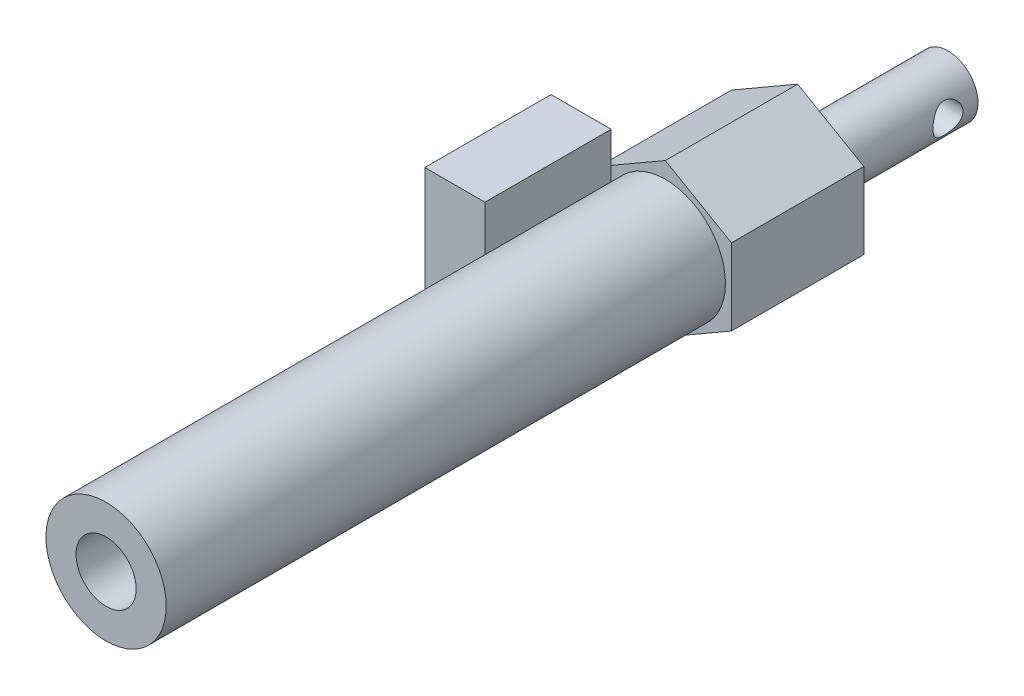
ISO-10303-21;
HEADER;
FILE_DESCRIPTION(('STEP AP214'),'2;1');
FILE_NAME('part.step','',(''),(''),'','','');
FILE_SCHEMA(('AUTOMOTIVE_DESIGN { 1 0 10303 214 1 1 1 1 }'));
ENDSEC;
DATA;
#1=APPLICATION_CONTEXT('core data for automotive mechanical design processes');
#2=APPLICATION_PROTOCOL_DEFINITION('international standard','automotive_design',2000,#1);
#3=PRODUCT_CONTEXT('',#1,'mechanical');
#4=PRODUCT('Part','Part','',(#3));
#5=PRODUCT_RELATED_PRODUCT_CATEGORY('part','',(#4));
#6=PRODUCT_DEFINITION_FORMATION('','',#4);
#7=PRODUCT_DEFINITION_CONTEXT('part definition',#1,'design');
#8=PRODUCT_DEFINITION('design','',#6,#7);
#9=PRODUCT_DEFINITION_SHAPE('','',#8);
#10=(LENGTH_UNIT() NAMED_UNIT(*) SI_UNIT(.MILLI.,.METRE.));
#11=(NAMED_UNIT(*) PLANE_ANGLE_UNIT() SI_UNIT($,.RADIAN.));
#12=(NAMED_UNIT(*) SI_UNIT($,.STERADIAN.) SOLID_ANGLE_UNIT());
#13=UNCERTAINTY_MEASURE_WITH_UNIT(LENGTH_MEASURE(1.E-05),#10,'distance_accuracy_value','');
#14=(GEOMETRIC_REPRESENTATION_CONTEXT(3) GLOBAL_UNCERTAINTY_ASSIGNED_CONTEXT((#13)) GLOBAL_UNIT_ASSIGNED_CONTEXT((#10,
#11,#12)) REPRESENTATION_CONTEXT('',''));
#15=CARTESIAN_POINT('',(0.,0.,0.));
#16=DIRECTION('',(0.,0.,1.));
#17=DIRECTION('',(1.,0.,0.));
#18=AXIS2_PLACEMENT_3D('',#15,#16,#17);
#19=CARTESIAN_POINT('',(0.,0.,115.));
#20=DIRECTION('',(0.,0.,-1.));
#21=DIRECTION('',(-1.,0.,0.));
#22=AXIS2_PLACEMENT_3D('',#19,#20,#21);
#23=CYLINDRICAL_SURFACE('',#22,10.);
#24=CARTESIAN_POINT('',(0.,0.,115.));
#25=DIRECTION('',(0.,0.,1.));
#26=DIRECTION('',(1.,0.,0.));
#27=AXIS2_PLACEMENT_3D('',#24,#25,#26);
#28=CIRCLE('',#27,10.);
#29=CARTESIAN_POINT('',(10.,0.,115.));
#30=VERTEX_POINT('',#29);
#31=EDGE_CURVE('E249',#30,#30,#28,.T.);
#32=ORIENTED_EDGE('',*,*,#31,.F.);
#33=EDGE_LOOP('',(#32));
#34=FACE_BOUND('',#33,.T.);
#35=CARTESIAN_POINT('',(0.,0.,43.));
#36=DIRECTION('',(0.,0.,-1.));
#37=DIRECTION('',(-1.,0.,0.));
#38=AXIS2_PLACEMENT_3D('',#35,#36,#37);
#39=CIRCLE('',#38,10.);
#40=CARTESIAN_POINT('',(-9.,-4.35889894354067,43.));
#41=VERTEX_POINT('',#40);
#42=CARTESIAN_POINT('',(-9.,4.35889894354068,43.));
#43=VERTEX_POINT('',#42);
#44=EDGE_CURVE('E41',#41,#43,#39,.T.);
#45=ORIENTED_EDGE('',*,*,#44,.F.);
#46=DIRECTION('',(0.,0.,-1.));
#47=VECTOR('',#46,1.);
#48=CARTESIAN_POINT('',(-9.,-4.35889894354067,115.));
#49=LINE('',#48,#47);
#50=CARTESIAN_POINT('',(-9.,-4.35889894354068,22.));
#51=VERTEX_POINT('',#50);
#52=EDGE_CURVE('E196',#41,#51,#49,.T.);
#53=ORIENTED_EDGE('',*,*,#52,.T.);
#54=CARTESIAN_POINT('',(0.,0.,22.));
#55=DIRECTION('',(0.,0.,-1.));
#56=DIRECTION('',(-1.,0.,0.));
#57=AXIS2_PLACEMENT_3D('',#54,#55,#56);
#58=CIRCLE('',#57,10.);
#59=CARTESIAN_POINT('',(-9.,4.35889894354067,22.));
#60=VERTEX_POINT('',#59);
#61=EDGE_CURVE('E253',#60,#51,#58,.T.);
#62=ORIENTED_EDGE('',*,*,#61,.F.);
#63=DIRECTION('',(0.,0.,-1.));
#64=VECTOR('',#63,1.);
#65=CARTESIAN_POINT('',(-9.,4.35889894354067,115.));
#66=LINE('',#65,#64);
#67=EDGE_CURVE('E154',#60,#43,#66,.F.);
#68=ORIENTED_EDGE('',*,*,#67,.T.);
#69=EDGE_LOOP('',(#45,#53,#62,#68));
#70=FACE_BOUND('',#69,.T.);
#71=ADVANCED_FACE('F38',(#34,#70),#23,.T.);
#72=CARTESIAN_POINT('',(0.,0.,115.));
#73=DIRECTION('',(0.,0.,1.));
#74=DIRECTION('',(1.,0.,0.));
#75=AXIS2_PLACEMENT_3D('',#72,#73,#74);
#76=PLANE('',#75);
#77=CARTESIAN_POINT('',(0.,0.,115.));
#78=DIRECTION('',(0.,0.,1.));
#79=DIRECTION('',(1.,0.,0.));
#80=AXIS2_PLACEMENT_3D('',#77,#78,#79);
#81=CIRCLE('',#80,5.);
#82=CARTESIAN_POINT('',(5.,0.,115.));
#83=VERTEX_POINT('',#82);
#84=EDGE_CURVE('E243',#83,#83,#81,.T.);
#85=ORIENTED_EDGE('',*,*,#84,.F.);
#86=EDGE_LOOP('',(#85));
#87=FACE_BOUND('',#86,.T.);
#88=ORIENTED_EDGE('',*,*,#31,.T.);
#89=EDGE_LOOP('',(#88));
#90=FACE_BOUND('',#89,.T.);
#91=ADVANCED_FACE('F287',(#87,#90),#76,.T.);
#92=CARTESIAN_POINT('',(0.,0.,5.));
#93=DIRECTION('',(0.,0.,1.));
#94=DIRECTION('',(1.,0.,0.));
#95=AXIS2_PLACEMENT_3D('',#92,#93,#94);
#96=CYLINDRICAL_SURFACE('',#95,5.);
#97=CARTESIAN_POINT('',(0.,0.,5.));
#98=DIRECTION('',(0.,0.,1.));
#99=DIRECTION('',(1.,0.,0.));
#100=AXIS2_PLACEMENT_3D('',#97,#98,#99);
#101=CIRCLE('',#100,5.);
#102=CARTESIAN_POINT('',(5.,0.,5.));
#103=VERTEX_POINT('',#102);
#104=EDGE_CURVE('E239',#103,#103,#101,.T.);
#105=ORIENTED_EDGE('',*,*,#104,.F.);
#106=EDGE_LOOP('',(#105));
#107=FACE_BOUND('',#106,.T.);
#108=ORIENTED_EDGE('',*,*,#84,.T.);
#109=EDGE_LOOP('',(#108));
#110=FACE_BOUND('',#109,.T.);
#111=ADVANCED_FACE('F284',(#107,#110),#96,.F.);
#112=CARTESIAN_POINT('',(0.,0.,5.));
#113=DIRECTION('',(0.,0.,1.));
#114=DIRECTION('',(1.,0.,0.));
#115=AXIS2_PLACEMENT_3D('',#112,#113,#114);
#116=PLANE('',#115);
#117=ORIENTED_EDGE('',*,*,#104,.T.);
#118=EDGE_LOOP('',(#117));
#119=FACE_BOUND('',#118,.T.);
#120=ADVANCED_FACE('F280',(#119),#116,.T.);
#121=CARTESIAN_POINT('',(11.,-6.35085296108589,22.));
#122=DIRECTION('',(0.5,-0.866025403784438,0.));
#123=DIRECTION('',(0.866025403784439,0.5,0.));
#124=AXIS2_PLACEMENT_3D('',#121,#122,#123);
#125=PLANE('',#124);
#126=DIRECTION('',(-0.866025403784439,-0.5,0.));
#127=VECTOR('',#126,1.);
#128=CARTESIAN_POINT('',(11.,-6.35085296108589,0.));
#129=LINE('',#128,#127);
#130=CARTESIAN_POINT('',(11.,-6.35085296108589,0.));
#131=VERTEX_POINT('',#130);
#132=CARTESIAN_POINT('',(0.,-12.7017059221718,0.));
#133=VERTEX_POINT('',#132);
#134=EDGE_CURVE('E199',#131,#133,#129,.T.);
#135=ORIENTED_EDGE('',*,*,#134,.F.);
#136=DIRECTION('',(0.,0.,-1.));
#137=VECTOR('',#136,1.);
#138=CARTESIAN_POINT('',(11.,-6.35085296108589,22.));
#139=LINE('',#138,#137);
#140=CARTESIAN_POINT('',(11.,-6.35085296108589,22.));
#141=VERTEX_POINT('',#140);
#142=EDGE_CURVE('E55',#141,#131,#139,.T.);
#143=ORIENTED_EDGE('',*,*,#142,.F.);
#144=DIRECTION('',(-0.866025403784439,-0.5,0.));
#145=VECTOR('',#144,1.);
#146=CARTESIAN_POINT('',(11.,-6.35085296108589,22.));
#147=LINE('',#146,#145);
#148=CARTESIAN_POINT('',(0.,-12.7017059221718,22.));
#149=VERTEX_POINT('',#148);
#150=EDGE_CURVE('E200',#141,#149,#147,.T.);
#151=ORIENTED_EDGE('',*,*,#150,.T.);
#152=DIRECTION('',(0.,0.,-1.));
#153=VECTOR('',#152,1.);
#154=CARTESIAN_POINT('',(0.,-12.7017059221718,22.));
#155=LINE('',#154,#153);
#156=EDGE_CURVE('E90',#149,#133,#155,.T.);
#157=ORIENTED_EDGE('',*,*,#156,.T.);
#158=EDGE_LOOP('',(#135,#143,#151,#157));
#159=FACE_BOUND('',#158,.T.);
#160=ADVANCED_FACE('F278',(#159),#125,.T.);
#161=CARTESIAN_POINT('',(11.,6.35085296108588,22.));
#162=DIRECTION('',(1.,0.,0.));
#163=DIRECTION('',(0.,1.,0.));
#164=AXIS2_PLACEMENT_3D('',#161,#162,#163);
#165=PLANE('',#164);
#166=DIRECTION('',(0.,-1.,0.));
#167=VECTOR('',#166,1.);
#168=CARTESIAN_POINT('',(11.,6.35085296108588,0.));
#169=LINE('',#168,#167);
#170=CARTESIAN_POINT('',(11.,6.35085296108588,0.));
#171=VERTEX_POINT('',#170);
#172=EDGE_CURVE('E203',#171,#131,#169,.T.);
#173=ORIENTED_EDGE('',*,*,#172,.F.);
#174=DIRECTION('',(0.,0.,-1.));
#175=VECTOR('',#174,1.);
#176=CARTESIAN_POINT('',(11.,6.35085296108588,22.));
#177=LINE('',#176,#175);
#178=CARTESIAN_POINT('',(11.,6.35085296108588,22.));
#179=VERTEX_POINT('',#178);
#180=EDGE_CURVE('E79',#179,#171,#177,.T.);
#181=ORIENTED_EDGE('',*,*,#180,.F.);
#182=DIRECTION('',(0.,-1.,0.));
#183=VECTOR('',#182,1.);
#184=CARTESIAN_POINT('',(11.,6.35085296108588,22.));
#185=LINE('',#184,#183);
#186=EDGE_CURVE('E212',#179,#141,#185,.T.);
#187=ORIENTED_EDGE('',*,*,#186,.T.);
#188=ORIENTED_EDGE('',*,*,#142,.T.);
#189=EDGE_LOOP('',(#173,#181,#187,#188));
#190=FACE_BOUND('',#189,.T.);
#191=ADVANCED_FACE('F330',(#190),#165,.T.);
#192=CARTESIAN_POINT('',(0.,12.7017059221718,22.));
#193=DIRECTION('',(0.5,0.866025403784439,0.));
#194=DIRECTION('',(-0.866025403784439,0.5,0.));
#195=AXIS2_PLACEMENT_3D('',#192,#193,#194);
#196=PLANE('',#195);
#197=DIRECTION('',(0.866025403784439,-0.5,0.));
#198=VECTOR('',#197,1.);
#199=CARTESIAN_POINT('',(0.,12.7017059221718,0.));
#200=LINE('',#199,#198);
#201=CARTESIAN_POINT('',(0.,12.7017059221718,0.));
#202=VERTEX_POINT('',#201);
#203=EDGE_CURVE('E225',#202,#171,#200,.T.);
#204=ORIENTED_EDGE('',*,*,#203,.F.);
#205=DIRECTION('',(0.,0.,-1.));
#206=VECTOR('',#205,1.);
#207=CARTESIAN_POINT('',(0.,12.7017059221718,22.));
#208=LINE('',#207,#206);
#209=CARTESIAN_POINT('',(0.,12.7017059221718,22.));
#210=VERTEX_POINT('',#209);
#211=EDGE_CURVE('E232',#210,#202,#208,.T.);
#212=ORIENTED_EDGE('',*,*,#211,.F.);
#213=DIRECTION('',(0.866025403784439,-0.5,0.));
#214=VECTOR('',#213,1.);
#215=CARTESIAN_POINT('',(0.,12.7017059221718,22.));
#216=LINE('',#215,#214);
#217=EDGE_CURVE('E210',#210,#179,#216,.T.);
#218=ORIENTED_EDGE('',*,*,#217,.T.);
#219=ORIENTED_EDGE('',*,*,#180,.T.);
#220=EDGE_LOOP('',(#204,#212,#218,#219));
#221=FACE_BOUND('',#220,.T.);
#222=ADVANCED_FACE('F332',(#221),#196,.T.);
#223=CARTESIAN_POINT('',(-11.,6.35085296108589,22.));
#224=DIRECTION('',(-0.5,0.866025403784439,0.));
#225=DIRECTION('',(-0.866025403784439,-0.5,0.));
#226=AXIS2_PLACEMENT_3D('',#223,#224,#225);
#227=PLANE('',#226);
#228=DIRECTION('',(0.866025403784439,0.5,0.));
#229=VECTOR('',#228,1.);
#230=CARTESIAN_POINT('',(-11.,6.35085296108589,0.));
#231=LINE('',#230,#229);
#232=CARTESIAN_POINT('',(-11.,6.35085296108589,0.));
#233=VERTEX_POINT('',#232);
#234=EDGE_CURVE('E222',#233,#202,#231,.T.);
#235=ORIENTED_EDGE('',*,*,#234,.F.);
#236=DIRECTION('',(0.,0.,-1.));
#237=VECTOR('',#236,1.);
#238=CARTESIAN_POINT('',(-11.,6.35085296108589,22.));
#239=LINE('',#238,#237);
#240=CARTESIAN_POINT('',(-11.,6.35085296108588,22.));
#241=VERTEX_POINT('',#240);
#242=EDGE_CURVE('E234',#241,#233,#239,.T.);
#243=ORIENTED_EDGE('',*,*,#242,.F.);
#244=DIRECTION('',(0.866025403784439,0.5,0.));
#245=VECTOR('',#244,1.);
#246=CARTESIAN_POINT('',(-11.,6.35085296108589,22.));
#247=LINE('',#246,#245);
#248=CARTESIAN_POINT('',(-9.,7.50555349946513,22.));
#249=VERTEX_POINT('',#248);
#250=EDGE_CURVE('E207',#241,#249,#247,.T.);
#251=ORIENTED_EDGE('',*,*,#250,.T.);
#252=EDGE_CURVE('E206',#249,#210,#247,.T.);
#253=ORIENTED_EDGE('',*,*,#252,.T.);
#254=ORIENTED_EDGE('',*,*,#211,.T.);
#255=EDGE_LOOP('',(#235,#243,#251,#253,#254));
#256=FACE_BOUND('',#255,.T.);
#257=ADVANCED_FACE('F334',(#256),#227,.T.);
#258=CARTESIAN_POINT('',(-11.,-6.35085296108588,22.));
#259=DIRECTION('',(-1.,0.,0.));
#260=DIRECTION('',(0.,0.,1.));
#261=AXIS2_PLACEMENT_3D('',#258,#259,#260);
#262=PLANE('',#261);
#263=DIRECTION('',(0.,-1.,0.));
#264=VECTOR('',#263,1.);
#265=CARTESIAN_POINT('',(-11.,-8.29829407782823,22.));
#266=LINE('',#265,#264);
#267=CARTESIAN_POINT('',(-11.,-6.35085296108588,22.));
#268=VERTEX_POINT('',#267);
#269=EDGE_CURVE('E11',#241,#268,#266,.T.);
#270=ORIENTED_EDGE('',*,*,#269,.F.);
#271=ORIENTED_EDGE('',*,*,#242,.T.);
#272=DIRECTION('',(0.,1.,0.));
#273=VECTOR('',#272,1.);
#274=CARTESIAN_POINT('',(-11.,-6.35085296108588,0.));
#275=LINE('',#274,#273);
#276=CARTESIAN_POINT('',(-11.,-6.35085296108588,0.));
#277=VERTEX_POINT('',#276);
#278=EDGE_CURVE('E219',#277,#233,#275,.T.);
#279=ORIENTED_EDGE('',*,*,#278,.F.);
#280=DIRECTION('',(0.,0.,-1.));
#281=VECTOR('',#280,1.);
#282=CARTESIAN_POINT('',(-11.,-6.35085296108588,22.));
#283=LINE('',#282,#281);
#284=EDGE_CURVE('E236',#268,#277,#283,.T.);
#285=ORIENTED_EDGE('',*,*,#284,.F.);
#286=EDGE_LOOP('',(#270,#271,#279,#285));
#287=FACE_BOUND('',#286,.T.);
#288=ADVANCED_FACE('F323',(#287),#262,.T.);
#289=CARTESIAN_POINT('',(0.,-12.7017059221718,22.));
#290=DIRECTION('',(-0.5,-0.866025403784439,0.));
#291=DIRECTION('',(0.866025403784439,-0.5,0.));
#292=AXIS2_PLACEMENT_3D('',#289,#290,#291);
#293=PLANE('',#292);
#294=DIRECTION('',(-0.866025403784439,0.5,0.));
#295=VECTOR('',#294,1.);
#296=CARTESIAN_POINT('',(0.,-12.7017059221718,0.));
#297=LINE('',#296,#295);
#298=EDGE_CURVE('E216',#133,#277,#297,.T.);
#299=ORIENTED_EDGE('',*,*,#298,.F.);
#300=ORIENTED_EDGE('',*,*,#156,.F.);
#301=DIRECTION('',(-0.866025403784439,0.5,0.));
#302=VECTOR('',#301,1.);
#303=CARTESIAN_POINT('',(0.,-12.7017059221718,22.));
#304=LINE('',#303,#302);
#305=CARTESIAN_POINT('',(-9.,-7.50555349946513,22.));
#306=VERTEX_POINT('',#305);
#307=EDGE_CURVE('E204',#149,#306,#304,.T.);
#308=ORIENTED_EDGE('',*,*,#307,.T.);
#309=EDGE_CURVE('E202',#306,#268,#304,.T.);
#310=ORIENTED_EDGE('',*,*,#309,.T.);
#311=ORIENTED_EDGE('',*,*,#284,.T.);
#312=EDGE_LOOP('',(#299,#300,#308,#310,#311));
#313=FACE_BOUND('',#312,.T.);
#314=ADVANCED_FACE('F295',(#313),#293,.T.);
#315=CARTESIAN_POINT('',(0.,0.,22.));
#316=DIRECTION('',(0.,0.,-1.));
#317=DIRECTION('',(-1.,0.,0.));
#318=AXIS2_PLACEMENT_3D('',#315,#316,#317);
#319=PLANE('',#318);
#320=ORIENTED_EDGE('',*,*,#252,.F.);
#321=DIRECTION('',(0.,-1.,0.));
#322=VECTOR('',#321,1.);
#323=CARTESIAN_POINT('',(-9.,0.,22.));
#324=LINE('',#323,#322);
#325=EDGE_CURVE('E312',#249,#60,#324,.T.);
#326=ORIENTED_EDGE('',*,*,#325,.T.);
#327=ORIENTED_EDGE('',*,*,#61,.T.);
#328=EDGE_CURVE('E314',#51,#306,#324,.T.);
#329=ORIENTED_EDGE('',*,*,#328,.T.);
#330=ORIENTED_EDGE('',*,*,#307,.F.);
#331=ORIENTED_EDGE('',*,*,#150,.F.);
#332=ORIENTED_EDGE('',*,*,#186,.F.);
#333=ORIENTED_EDGE('',*,*,#217,.F.);
#334=EDGE_LOOP('',(#320,#326,#327,#329,#330,#331,#332,#333));
#335=FACE_BOUND('',#334,.T.);
#336=ADVANCED_FACE('F290',(#335),#319,.F.);
#337=CARTESIAN_POINT('',(0.,0.,-25.));
#338=DIRECTION('',(0.,0.,-1.));
#339=DIRECTION('',(-1.,0.,0.));
#340=AXIS2_PLACEMENT_3D('',#337,#338,#339);
#341=PLANE('',#340);
#342=CARTESIAN_POINT('',(0.,0.,-25.));
#343=DIRECTION('',(0.,0.,-1.));
#344=DIRECTION('',(-1.,0.,0.));
#345=AXIS2_PLACEMENT_3D('',#342,#343,#344);
#346=CIRCLE('',#345,5.);
#347=CARTESIAN_POINT('',(-5.,0.,-25.));
#348=VERTEX_POINT('',#347);
#349=EDGE_CURVE('E242',#348,#348,#346,.T.);
#350=ORIENTED_EDGE('',*,*,#349,.T.);
#351=EDGE_LOOP('',(#350));
#352=FACE_BOUND('',#351,.T.);
#353=ADVANCED_FACE('F276',(#352),#341,.T.);
#354=CARTESIAN_POINT('',(-10.,0.,-20.));
#355=DIRECTION('',(1.,0.,0.));
#356=DIRECTION('',(0.,0.,-1.));
#357=AXIS2_PLACEMENT_3D('',#354,#355,#356);
#358=CYLINDRICAL_SURFACE('',#357,2.5);
#359=CARTESIAN_POINT('',(-5.,0.,-22.5));
#360=CARTESIAN_POINT('',(-4.99999177550472,0.131426682334305,-22.499990330944));
#361=CARTESIAN_POINT('',(-4.99476199135277,0.263015634437213,-22.489574438226));
#362=CARTESIAN_POINT('',(-4.9743541856102,0.522301454622883,-22.4483681788379));
#363=CARTESIAN_POINT('',(-4.9591572718767,0.649990448564105,-22.417539119075));
#364=CARTESIAN_POINT('',(-4.92040690922477,0.897333631316203,-22.3370153772812));
#365=CARTESIAN_POINT('',(-4.89688595907259,1.01701694536277,-22.2873940122173));
#366=CARTESIAN_POINT('',(-4.84364443325827,1.24618160399671,-22.1710734737482));
#367=CARTESIAN_POINT('',(-4.81392434644421,1.3556637520377,-22.1043756468549));
#368=CARTESIAN_POINT('',(-4.74890645050632,1.56876952630998,-21.9512068683574));
#369=CARTESIAN_POINT('',(-4.71337997659091,1.67163802294308,-21.8637837997702));
#370=CARTESIAN_POINT('',(-4.64149925776731,1.86194861703332,-21.6736963040147));
#371=CARTESIAN_POINT('',(-4.60514440566897,1.94937895911555,-21.5710203711599));
#372=CARTESIAN_POINT('',(-4.53247377945622,2.11312999967247,-21.3437916255547));
#373=CARTESIAN_POINT('',(-4.49637967412567,2.18806333849064,-21.218159753965));
#374=CARTESIAN_POINT('',(-4.43214946943555,2.31542056761491,-20.9540816602046));
#375=CARTESIAN_POINT('',(-4.40400769020792,2.36786053751682,-20.8156446782374));
#376=CARTESIAN_POINT('',(-4.36144667591402,2.44533110537653,-20.5383372364036));
#377=CARTESIAN_POINT('',(-4.34630678958452,2.47181464267578,-20.3999888698204));
#378=CARTESIAN_POINT('',(-4.3295472487215,2.50106748329741,-20.1200529055624));
#379=CARTESIAN_POINT('',(-4.3279142335843,2.50386022093906,-19.9784686478249));
#380=CARTESIAN_POINT('',(-4.33777325642937,2.48671821792512,-19.7142849392091));
#381=CARTESIAN_POINT('',(-4.34771909154984,2.46946139884055,-19.5914399219417));
#382=CARTESIAN_POINT('',(-4.37690571834675,2.41734962264384,-19.3506952265681));
#383=CARTESIAN_POINT('',(-4.39614947079454,2.38248905974454,-19.2327971367369));
#384=CARTESIAN_POINT('',(-4.44218691031839,2.29552445096459,-19.0019271685857));
#385=CARTESIAN_POINT('',(-4.46914601659993,2.24303766778987,-18.8891340030355));
#386=CARTESIAN_POINT('',(-4.52758510703513,2.12260421917012,-18.673414268525));
#387=CARTESIAN_POINT('',(-4.55906711950478,2.0546506095312,-18.5704921609998));
#388=CARTESIAN_POINT('',(-4.62782894758213,1.89516513728193,-18.3636968681419));
#389=CARTESIAN_POINT('',(-4.66533775591865,1.80173614592319,-18.2613578160596));
#390=CARTESIAN_POINT('',(-4.73869058251019,1.59888894685344,-18.0731614535227));
#391=CARTESIAN_POINT('',(-4.77453379897003,1.48946314143571,-17.9873120199153));
#392=CARTESIAN_POINT('',(-4.84254968207409,1.25129126457962,-17.8307858474257));
#393=CARTESIAN_POINT('',(-4.87447460405015,1.12188397899853,-17.7609988188856));
#394=CARTESIAN_POINT('',(-4.92894702803108,0.851165538721983,-17.6447574273925));
#395=CARTESIAN_POINT('',(-4.95150197358893,0.70986394066316,-17.5982845374621));
#396=CARTESIAN_POINT('',(-4.98310834353579,0.431916229151778,-17.5338114907083));
#397=CARTESIAN_POINT('',(-4.9931234575324,0.295853826370904,-17.513771910633));
#398=CARTESIAN_POINT('',(-5.00182533647794,0.0219489998732874,-17.4963381721638));
#399=CARTESIAN_POINT('',(-5.00051746803426,-0.11589254967511,-17.4989332859015));
#400=CARTESIAN_POINT('',(-4.98727980633468,-0.378082429964656,-17.5255167210467));
#401=CARTESIAN_POINT('',(-4.97618114219992,-0.502648520123705,-17.5478313318244));
#402=CARTESIAN_POINT('',(-4.94555428287529,-0.746017230755971,-17.6105951797384));
#403=CARTESIAN_POINT('',(-4.92602515837625,-0.864819214231883,-17.6510464161359));
#404=CARTESIAN_POINT('',(-4.87960628532329,-1.09722152111965,-17.7499961660804));
#405=CARTESIAN_POINT('',(-4.85252204417873,-1.21057599249831,-17.8089776252823));
#406=CARTESIAN_POINT('',(-4.7935993579975,-1.42615340426439,-17.9427688391248));
#407=CARTESIAN_POINT('',(-4.76175888940534,-1.52837157450203,-18.0175853365199));
#408=CARTESIAN_POINT('',(-4.69270553315087,-1.72941922315487,-18.1894010632909));
#409=CARTESIAN_POINT('',(-4.65527212009488,-1.82693019428496,-18.2878571709752));
#410=CARTESIAN_POINT('',(-4.58155978921587,-2.0046408025722,-18.4998128780494));
#411=CARTESIAN_POINT('',(-4.54528168472407,-2.08482846428685,-18.6133227970699));
#412=CARTESIAN_POINT('',(-4.4762798054528,-2.22926978618995,-18.8591091354847));
#413=CARTESIAN_POINT('',(-4.44381323981254,-2.29256373922243,-18.9920281652911));
#414=CARTESIAN_POINT('',(-4.38935180726746,-2.39520706511459,-19.2687751688826));
#415=CARTESIAN_POINT('',(-4.36734345549014,-2.43458729077055,-19.412588816));
#416=CARTESIAN_POINT('',(-4.33903752569351,-2.48465421767005,-19.6922755573629));
#417=CARTESIAN_POINT('',(-4.33143458674096,-2.4977324874436,-19.827585634119));
#418=CARTESIAN_POINT('',(-4.32913386592579,-2.50172288950898,-20.0986176673807));
#419=CARTESIAN_POINT('',(-4.33443049025111,-2.49264462983266,-20.2343394198736));
#420=CARTESIAN_POINT('',(-4.35594655164663,-2.45481530197332,-20.4887087556168));
#421=CARTESIAN_POINT('',(-4.37107736338133,-2.42802074302696,-20.6077511817208));
#422=CARTESIAN_POINT('',(-4.40927540337603,-2.35793843840543,-20.8395202922));
#423=CARTESIAN_POINT('',(-4.43234518434965,-2.31464538728732,-20.9522449315665));
#424=CARTESIAN_POINT('',(-4.48571326433413,-2.20953919315538,-21.1765621527197));
#425=CARTESIAN_POINT('',(-4.5163930799845,-2.14667719009403,-21.287569851735));
#426=CARTESIAN_POINT('',(-4.58088327077455,-2.0053780838799,-21.49818624324));
#427=CARTESIAN_POINT('',(-4.61469526970767,-1.92693287765888,-21.5977889626287));
#428=CARTESIAN_POINT('',(-4.68655816327011,-1.74550556946065,-21.7953553637496));
#429=CARTESIAN_POINT('',(-4.7246249151498,-1.6407002246921,-21.8916493641714));
#430=CARTESIAN_POINT('',(-4.79694347383545,-1.41539785420684,-22.065655849428));
#431=CARTESIAN_POINT('',(-4.83119321905446,-1.29489242426332,-22.1433583186059));
#432=CARTESIAN_POINT('',(-4.89245149457782,-1.03978808878536,-22.2780969794841));
#433=CARTESIAN_POINT('',(-4.91940711437488,-0.905095560782286,-22.3349831677845));
#434=CARTESIAN_POINT('',(-4.95177960923351,-0.696328709257349,-22.4021838587924));
#435=CARTESIAN_POINT('',(-4.96122314081874,-0.625670413494086,-22.4215553980018));
#436=CARTESIAN_POINT('',(-4.97717127275101,-0.482623997839255,-22.4540659483706));
#437=CARTESIAN_POINT('',(-4.98367766823159,-0.410236963092399,-22.4672087666763));
#438=CARTESIAN_POINT('',(-4.9923820076613,-0.28151868462167,-22.4847374722846));
#439=CARTESIAN_POINT('',(-4.99523288466454,-0.225408499555444,-22.4904549365313));
#440=CARTESIAN_POINT('',(-4.99904367329659,-0.112875528456289,-22.4980883294657));
#441=CARTESIAN_POINT('',(-5.00000353273198,-0.056452733838218,-22.5000041532255));
#442=CARTESIAN_POINT('',(-5.,0.,-22.5));
#443=B_SPLINE_CURVE_WITH_KNOTS('',3,(#359,#360,#361,#362,#363,#364,#365,#366,#367,#368,#369,
#370,#371,#372,#373,#374,#375,#376,#377,#378,#379,#380,#381,#382,#383,#384,#385,#386,#387,#388,
#389,#390,#391,#392,#393,#394,#395,#396,#397,#398,#399,#400,#401,#402,#403,#404,#405,#406,#407,
#408,#409,#410,#411,#412,#413,#414,#415,#416,#417,#418,#419,#420,#421,#422,#423,#424,#425,#426,
#427,#428,#429,#430,#431,#432,#433,#434,#435,#436,#437,#438,#439,#440,#441,#442),.UNSPECIFIED.,
.T.,.F.,(4,2,2,2,2,2,2,2,2,2,2,2,2,2,2,2,2,2,2,2,2,2,2,2,2,2,2,2,2,2,2,2,2,2,2,2,2,2,2,2,2,4),
(0.,0.394060643550731,0.788870374272994,1.18215538873075,1.57540940145392,1.99245439679522,
2.40981559413509,2.85954316076882,3.30894869745702,3.73145030350574,4.15353393322551,
4.52514281023301,4.89687009814196,5.27725600421218,5.65781303150554,6.08662353334696,
6.51563836496716,6.96457555536101,7.41315542280699,7.82458226178364,8.2358141127869,
8.61517266265304,8.99457304077328,9.38482140069746,9.77523626870848,10.2039902661037,
10.6330397153795,11.0828670540368,11.53211279863,11.9382326875698,12.3441764966106,
12.7114482562151,13.0788382197025,13.4709114195009,13.8631890285845,14.303131068923,
14.7433095845248,15.1866003415818,15.407934939208,15.6291340766843,15.7983933645035,
15.9676573239322),.UNSPECIFIED.);
#444=CARTESIAN_POINT('',(-5.,0.,-22.5));
#445=VERTEX_POINT('',#444);
#446=EDGE_CURVE('E230',#445,#445,#443,.T.);
#447=ORIENTED_EDGE('',*,*,#446,.F.);
#448=EDGE_LOOP('',(#447));
#449=FACE_BOUND('',#448,.T.);
#450=CARTESIAN_POINT('',(5.,0.,-22.5));
#451=CARTESIAN_POINT('',(4.99999177550472,-0.131426682334305,-22.499990330944));
#452=CARTESIAN_POINT('',(4.99476199135277,-0.263015634437213,-22.489574438226));
#453=CARTESIAN_POINT('',(4.9743541856102,-0.522301454622883,-22.4483681788379));
#454=CARTESIAN_POINT('',(4.9591572718767,-0.649990448564105,-22.417539119075));
#455=CARTESIAN_POINT('',(4.92040690922477,-0.897333631316203,-22.3370153772812));
#456=CARTESIAN_POINT('',(4.89688595907259,-1.01701694536277,-22.2873940122173));
#457=CARTESIAN_POINT('',(4.84364443325827,-1.24618160399671,-22.1710734737482));
#458=CARTESIAN_POINT('',(4.81392434644421,-1.3556637520377,-22.1043756468549));
#459=CARTESIAN_POINT('',(4.74890645050632,-1.56876952630998,-21.9512068683574));
#460=CARTESIAN_POINT('',(4.71337997659091,-1.67163802294308,-21.8637837997702));
#461=CARTESIAN_POINT('',(4.64149925776731,-1.86194861703332,-21.6736963040147));
#462=CARTESIAN_POINT('',(4.60514440566897,-1.94937895911555,-21.5710203711599));
#463=CARTESIAN_POINT('',(4.53247377945622,-2.11312999967247,-21.3437916255547));
#464=CARTESIAN_POINT('',(4.49637967412567,-2.18806333849064,-21.218159753965));
#465=CARTESIAN_POINT('',(4.43214946943555,-2.31542056761491,-20.9540816602046));
#466=CARTESIAN_POINT('',(4.40400769020792,-2.36786053751682,-20.8156446782374));
#467=CARTESIAN_POINT('',(4.36144667591402,-2.44533110537653,-20.5383372364036));
#468=CARTESIAN_POINT('',(4.34630678958452,-2.47181464267578,-20.3999888698204));
#469=CARTESIAN_POINT('',(4.3295472487215,-2.50106748329741,-20.1200529055624));
#470=CARTESIAN_POINT('',(4.3279142335843,-2.50386022093906,-19.9784686478249));
#471=CARTESIAN_POINT('',(4.33777325642937,-2.48671821792512,-19.7142849392091));
#472=CARTESIAN_POINT('',(4.34771909154984,-2.46946139884055,-19.5914399219417));
#473=CARTESIAN_POINT('',(4.37690571834675,-2.41734962264384,-19.3506952265681));
#474=CARTESIAN_POINT('',(4.39614947079454,-2.38248905974454,-19.2327971367369));
#475=CARTESIAN_POINT('',(4.44218691031839,-2.29552445096459,-19.0019271685857));
#476=CARTESIAN_POINT('',(4.46914601659993,-2.24303766778987,-18.8891340030355));
#477=CARTESIAN_POINT('',(4.52758510703513,-2.12260421917012,-18.673414268525));
#478=CARTESIAN_POINT('',(4.55906711950478,-2.0546506095312,-18.5704921609998));
#479=CARTESIAN_POINT('',(4.62782894758213,-1.89516513728193,-18.3636968681419));
#480=CARTESIAN_POINT('',(4.66533775591865,-1.80173614592319,-18.2613578160596));
#481=CARTESIAN_POINT('',(4.73869058251019,-1.59888894685344,-18.0731614535227));
#482=CARTESIAN_POINT('',(4.77453379897003,-1.48946314143571,-17.9873120199153));
#483=CARTESIAN_POINT('',(4.84254968207409,-1.25129126457962,-17.8307858474257));
#484=CARTESIAN_POINT('',(4.87447460405015,-1.12188397899853,-17.7609988188856));
#485=CARTESIAN_POINT('',(4.92894702803108,-0.851165538721983,-17.6447574273925));
#486=CARTESIAN_POINT('',(4.95150197358893,-0.70986394066316,-17.5982845374621));
#487=CARTESIAN_POINT('',(4.98310834353579,-0.431916229151778,-17.5338114907083));
#488=CARTESIAN_POINT('',(4.9931234575324,-0.295853826370904,-17.513771910633));
#489=CARTESIAN_POINT('',(5.00182533647794,-0.0219489998732874,-17.4963381721638));
#490=CARTESIAN_POINT('',(5.00051746803426,0.11589254967511,-17.4989332859015));
#491=CARTESIAN_POINT('',(4.98727980633468,0.378082429964656,-17.5255167210467));
#492=CARTESIAN_POINT('',(4.97618114219992,0.502648520123705,-17.5478313318244));
#493=CARTESIAN_POINT('',(4.94555428287529,0.746017230755971,-17.6105951797384));
#494=CARTESIAN_POINT('',(4.92602515837625,0.864819214231883,-17.6510464161359));
#495=CARTESIAN_POINT('',(4.87960628532329,1.09722152111965,-17.7499961660804));
#496=CARTESIAN_POINT('',(4.85252204417873,1.21057599249831,-17.8089776252823));
#497=CARTESIAN_POINT('',(4.7935993579975,1.42615340426439,-17.9427688391248));
#498=CARTESIAN_POINT('',(4.76175888940534,1.52837157450203,-18.0175853365199));
#499=CARTESIAN_POINT('',(4.69270553315087,1.72941922315487,-18.1894010632909));
#500=CARTESIAN_POINT('',(4.65527212009488,1.82693019428496,-18.2878571709752));
#501=CARTESIAN_POINT('',(4.58155978921587,2.0046408025722,-18.4998128780494));
#502=CARTESIAN_POINT('',(4.54528168472407,2.08482846428685,-18.6133227970699));
#503=CARTESIAN_POINT('',(4.4762798054528,2.22926978618995,-18.8591091354847));
#504=CARTESIAN_POINT('',(4.44381323981254,2.29256373922243,-18.9920281652911));
#505=CARTESIAN_POINT('',(4.38935180726746,2.39520706511459,-19.2687751688826));
#506=CARTESIAN_POINT('',(4.36734345549014,2.43458729077055,-19.412588816));
#507=CARTESIAN_POINT('',(4.33903752569351,2.48465421767005,-19.6922755573629));
#508=CARTESIAN_POINT('',(4.33143458674096,2.4977324874436,-19.827585634119));
#509=CARTESIAN_POINT('',(4.32913386592579,2.50172288950898,-20.0986176673807));
#510=CARTESIAN_POINT('',(4.33443049025111,2.49264462983266,-20.2343394198736));
#511=CARTESIAN_POINT('',(4.35594655164663,2.45481530197332,-20.4887087556168));
#512=CARTESIAN_POINT('',(4.37107736338133,2.42802074302696,-20.6077511817208));
#513=CARTESIAN_POINT('',(4.40927540337603,2.35793843840543,-20.8395202922));
#514=CARTESIAN_POINT('',(4.43234518434965,2.31464538728732,-20.9522449315665));
#515=CARTESIAN_POINT('',(4.48571326433413,2.20953919315538,-21.1765621527197));
#516=CARTESIAN_POINT('',(4.5163930799845,2.14667719009403,-21.287569851735));
#517=CARTESIAN_POINT('',(4.58088327077455,2.0053780838799,-21.49818624324));
#518=CARTESIAN_POINT('',(4.61469526970767,1.92693287765888,-21.5977889626287));
#519=CARTESIAN_POINT('',(4.68655816327011,1.74550556946065,-21.7953553637496));
#520=CARTESIAN_POINT('',(4.7246249151498,1.6407002246921,-21.8916493641714));
#521=CARTESIAN_POINT('',(4.79694347383545,1.41539785420684,-22.065655849428));
#522=CARTESIAN_POINT('',(4.83119321905446,1.29489242426332,-22.1433583186059));
#523=CARTESIAN_POINT('',(4.89245149457782,1.03978808878536,-22.2780969794841));
#524=CARTESIAN_POINT('',(4.91940711437488,0.905095560782286,-22.3349831677845));
#525=CARTESIAN_POINT('',(4.95177960923351,0.696328709257349,-22.4021838587924));
#526=CARTESIAN_POINT('',(4.96122314081874,0.625670413494086,-22.4215553980018));
#527=CARTESIAN_POINT('',(4.97717127275101,0.482623997839255,-22.4540659483706));
#528=CARTESIAN_POINT('',(4.98367766823159,0.410236963092399,-22.4672087666763));
#529=CARTESIAN_POINT('',(4.9923820076613,0.28151868462167,-22.4847374722846));
#530=CARTESIAN_POINT('',(4.99523288466454,0.225408499555444,-22.4904549365313));
#531=CARTESIAN_POINT('',(4.99904367329659,0.112875528456289,-22.4980883294657));
#532=CARTESIAN_POINT('',(5.00000353273198,0.056452733838218,-22.5000041532255));
#533=CARTESIAN_POINT('',(5.,0.,-22.5));
#534=B_SPLINE_CURVE_WITH_KNOTS('',3,(#450,#451,#452,#453,#454,#455,#456,#457,#458,#459,#460,
#461,#462,#463,#464,#465,#466,#467,#468,#469,#470,#471,#472,#473,#474,#475,#476,#477,#478,#479,
#480,#481,#482,#483,#484,#485,#486,#487,#488,#489,#490,#491,#492,#493,#494,#495,#496,#497,#498,
#499,#500,#501,#502,#503,#504,#505,#506,#507,#508,#509,#510,#511,#512,#513,#514,#515,#516,#517,
#518,#519,#520,#521,#522,#523,#524,#525,#526,#527,#528,#529,#530,#531,#532,#533),.UNSPECIFIED.,
.T.,.F.,(4,2,2,2,2,2,2,2,2,2,2,2,2,2,2,2,2,2,2,2,2,2,2,2,2,2,2,2,2,2,2,2,2,2,2,2,2,2,2,2,2,4),
(0.,0.394060643550731,0.788870374272994,1.18215538873075,1.57540940145392,1.99245439679522,
2.40981559413509,2.85954316076882,3.30894869745702,3.73145030350574,4.15353393322551,
4.52514281023301,4.89687009814196,5.27725600421218,5.65781303150554,6.08662353334696,
6.51563836496716,6.96457555536101,7.41315542280699,7.82458226178364,8.2358141127869,
8.61517266265304,8.99457304077328,9.38482140069746,9.77523626870848,10.2039902661037,
10.6330397153795,11.0828670540368,11.53211279863,11.9382326875698,12.3441764966106,
12.7114482562151,13.0788382197025,13.4709114195009,13.8631890285845,14.303131068923,
14.7433095845248,15.1866003415818,15.407934939208,15.6291340766843,15.7983933645035,
15.9676573239322),.UNSPECIFIED.);
#535=CARTESIAN_POINT('',(5.,0.,-22.5));
#536=VERTEX_POINT('',#535);
#537=EDGE_CURVE('E246',#536,#536,#534,.T.);
#538=ORIENTED_EDGE('',*,*,#537,.F.);
#539=EDGE_LOOP('',(#538));
#540=FACE_BOUND('',#539,.T.);
#541=ADVANCED_FACE('F271',(#449,#540),#358,.F.);
#542=CARTESIAN_POINT('',(0.,0.,-25.));
#543=DIRECTION('',(0.,0.,1.));
#544=DIRECTION('',(1.,0.,0.));
#545=AXIS2_PLACEMENT_3D('',#542,#543,#544);
#546=CYLINDRICAL_SURFACE('',#545,5.);
#547=ORIENTED_EDGE('',*,*,#537,.T.);
#548=EDGE_LOOP('',(#547));
#549=FACE_BOUND('',#548,.T.);
#550=ORIENTED_EDGE('',*,*,#446,.T.);
#551=EDGE_LOOP('',(#550));
#552=FACE_BOUND('',#551,.T.);
#553=ORIENTED_EDGE('',*,*,#349,.F.);
#554=EDGE_LOOP('',(#553));
#555=FACE_BOUND('',#554,.T.);
#556=CARTESIAN_POINT('',(0.,0.,0.));
#557=DIRECTION('',(0.,0.,-1.));
#558=DIRECTION('',(-1.,0.,0.));
#559=AXIS2_PLACEMENT_3D('',#556,#557,#558);
#560=CIRCLE('',#559,5.);
#561=CARTESIAN_POINT('',(-5.,0.,0.));
#562=VERTEX_POINT('',#561);
#563=EDGE_CURVE('E250',#562,#562,#560,.T.);
#564=ORIENTED_EDGE('',*,*,#563,.T.);
#565=EDGE_LOOP('',(#564));
#566=FACE_BOUND('',#565,.T.);
#567=ADVANCED_FACE('F267',(#549,#552,#555,#566),#546,.T.);
#568=CARTESIAN_POINT('',(0.,0.,0.));
#569=DIRECTION('',(0.,0.,1.));
#570=DIRECTION('',(1.,0.,0.));
#571=AXIS2_PLACEMENT_3D('',#568,#569,#570);
#572=PLANE('',#571);
#573=ORIENTED_EDGE('',*,*,#563,.F.);
#574=EDGE_LOOP('',(#573));
#575=FACE_BOUND('',#574,.T.);
#576=ORIENTED_EDGE('',*,*,#134,.T.);
#577=ORIENTED_EDGE('',*,*,#298,.T.);
#578=ORIENTED_EDGE('',*,*,#278,.T.);
#579=ORIENTED_EDGE('',*,*,#234,.T.);
#580=ORIENTED_EDGE('',*,*,#203,.T.);
#581=ORIENTED_EDGE('',*,*,#172,.T.);
#582=EDGE_LOOP('',(#576,#577,#578,#579,#580,#581));
#583=FACE_BOUND('',#582,.T.);
#584=ADVANCED_FACE('F327',(#575,#583),#572,.F.);
#585=CARTESIAN_POINT('',(-9.,-8.29829407782823,22.));
#586=DIRECTION('',(0.,0.,1.));
#587=DIRECTION('',(1.,0.,0.));
#588=AXIS2_PLACEMENT_3D('',#585,#586,#587);
#589=PLANE('',#588);
#590=ORIENTED_EDGE('',*,*,#250,.F.);
#591=ORIENTED_EDGE('',*,*,#269,.T.);
#592=ORIENTED_EDGE('',*,*,#309,.F.);
#593=DIRECTION('',(0.,1.,0.));
#594=VECTOR('',#593,1.);
#595=CARTESIAN_POINT('',(-9.,-8.29829407782823,22.));
#596=LINE('',#595,#594);
#597=CARTESIAN_POINT('',(-9.,-8.29829407782823,22.));
#598=VERTEX_POINT('',#597);
#599=EDGE_CURVE('E150',#598,#306,#596,.T.);
#600=ORIENTED_EDGE('',*,*,#599,.F.);
#601=DIRECTION('',(-1.,0.,0.));
#602=VECTOR('',#601,1.);
#603=CARTESIAN_POINT('',(-9.,-8.29829407782823,22.));
#604=LINE('',#603,#602);
#605=CARTESIAN_POINT('',(-19.,-8.29829407782823,22.));
#606=VERTEX_POINT('',#605);
#607=EDGE_CURVE('E142',#598,#606,#604,.T.);
#608=ORIENTED_EDGE('',*,*,#607,.T.);
#609=DIRECTION('',(0.,-1.,0.));
#610=VECTOR('',#609,1.);
#611=CARTESIAN_POINT('',(-19.,-8.29829407782823,22.));
#612=LINE('',#611,#610);
#613=CARTESIAN_POINT('',(-19.,12.7017059221718,22.));
#614=VERTEX_POINT('',#613);
#615=EDGE_CURVE('E148',#614,#606,#612,.T.);
#616=ORIENTED_EDGE('',*,*,#615,.F.);
#617=DIRECTION('',(-1.,0.,0.));
#618=VECTOR('',#617,1.);
#619=CARTESIAN_POINT('',(-9.,12.7017059221718,22.));
#620=LINE('',#619,#618);
#621=CARTESIAN_POINT('',(-9.,12.7017059221718,22.));
#622=VERTEX_POINT('',#621);
#623=EDGE_CURVE('E155',#622,#614,#620,.T.);
#624=ORIENTED_EDGE('',*,*,#623,.F.);
#625=EDGE_CURVE('E182',#249,#622,#596,.T.);
#626=ORIENTED_EDGE('',*,*,#625,.F.);
#627=EDGE_LOOP('',(#590,#591,#592,#600,#608,#616,#624,#626));
#628=FACE_BOUND('',#627,.T.);
#629=ADVANCED_FACE('F145',(#628),#589,.F.);
#630=CARTESIAN_POINT('',(-9.,0.,0.));
#631=DIRECTION('',(1.,0.,0.));
#632=DIRECTION('',(0.,0.,-1.));
#633=AXIS2_PLACEMENT_3D('',#630,#631,#632);
#634=PLANE('',#633);
#635=ORIENTED_EDGE('',*,*,#52,.F.);
#636=DIRECTION('',(0.,-1.,0.));
#637=VECTOR('',#636,1.);
#638=CARTESIAN_POINT('',(-9.,12.7017059221718,43.));
#639=LINE('',#638,#637);
#640=CARTESIAN_POINT('',(-9.,-8.29829407782823,43.));
#641=VERTEX_POINT('',#640);
#642=EDGE_CURVE('E186',#41,#641,#639,.T.);
#643=ORIENTED_EDGE('',*,*,#642,.T.);
#644=DIRECTION('',(0.,0.,-1.));
#645=VECTOR('',#644,1.);
#646=CARTESIAN_POINT('',(-9.,-8.29829407782823,43.));
#647=LINE('',#646,#645);
#648=EDGE_CURVE('E179',#641,#598,#647,.T.);
#649=ORIENTED_EDGE('',*,*,#648,.T.);
#650=ORIENTED_EDGE('',*,*,#599,.T.);
#651=ORIENTED_EDGE('',*,*,#328,.F.);
#652=EDGE_LOOP('',(#635,#643,#649,#650,#651));
#653=FACE_BOUND('',#652,.T.);
#654=ADVANCED_FACE('F353',(#653),#634,.T.);
#655=ORIENTED_EDGE('',*,*,#67,.F.);
#656=ORIENTED_EDGE('',*,*,#325,.F.);
#657=ORIENTED_EDGE('',*,*,#625,.T.);
#658=DIRECTION('',(0.,0.,1.));
#659=VECTOR('',#658,1.);
#660=CARTESIAN_POINT('',(-9.,12.7017059221718,22.));
#661=LINE('',#660,#659);
#662=CARTESIAN_POINT('',(-9.,12.7017059221718,43.));
#663=VERTEX_POINT('',#662);
#664=EDGE_CURVE('E184',#622,#663,#661,.T.);
#665=ORIENTED_EDGE('',*,*,#664,.T.);
#666=EDGE_CURVE('E187',#663,#43,#639,.T.);
#667=ORIENTED_EDGE('',*,*,#666,.T.);
#668=EDGE_LOOP('',(#655,#656,#657,#665,#667));
#669=FACE_BOUND('',#668,.T.);
#670=ADVANCED_FACE('F337',(#669),#634,.T.);
#671=CARTESIAN_POINT('',(-9.,-8.29829407782823,43.));
#672=DIRECTION('',(0.,1.,0.));
#673=DIRECTION('',(0.,0.,1.));
#674=AXIS2_PLACEMENT_3D('',#671,#672,#673);
#675=PLANE('',#674);
#676=DIRECTION('',(-1.,0.,0.));
#677=VECTOR('',#676,1.);
#678=CARTESIAN_POINT('',(-9.,-8.29829407782823,43.));
#679=LINE('',#678,#677);
#680=CARTESIAN_POINT('',(-19.,-8.29829407782823,43.));
#681=VERTEX_POINT('',#680);
#682=EDGE_CURVE('E161',#641,#681,#679,.T.);
#683=ORIENTED_EDGE('',*,*,#682,.T.);
#684=DIRECTION('',(0.,0.,1.));
#685=VECTOR('',#684,1.);
#686=CARTESIAN_POINT('',(-19.,-8.29829407782823,22.));
#687=LINE('',#686,#685);
#688=EDGE_CURVE('E158',#606,#681,#687,.T.);
#689=ORIENTED_EDGE('',*,*,#688,.F.);
#690=ORIENTED_EDGE('',*,*,#607,.F.);
#691=ORIENTED_EDGE('',*,*,#648,.F.);
#692=EDGE_LOOP('',(#683,#689,#690,#691));
#693=FACE_BOUND('',#692,.T.);
#694=ADVANCED_FACE('F159',(#693),#675,.F.);
#695=CARTESIAN_POINT('',(-9.,12.7017059221718,22.));
#696=DIRECTION('',(0.,-1.,0.));
#697=DIRECTION('',(0.,0.,-1.));
#698=AXIS2_PLACEMENT_3D('',#695,#696,#697);
#699=PLANE('',#698);
#700=ORIENTED_EDGE('',*,*,#623,.T.);
#701=DIRECTION('',(0.,0.,-1.));
#702=VECTOR('',#701,1.);
#703=CARTESIAN_POINT('',(-19.,12.7017059221718,22.));
#704=LINE('',#703,#702);
#705=CARTESIAN_POINT('',(-19.,12.7017059221718,43.));
#706=VERTEX_POINT('',#705);
#707=EDGE_CURVE('E170',#706,#614,#704,.T.);
#708=ORIENTED_EDGE('',*,*,#707,.F.);
#709=DIRECTION('',(-1.,0.,0.));
#710=VECTOR('',#709,1.);
#711=CARTESIAN_POINT('',(-9.,12.7017059221718,43.));
#712=LINE('',#711,#710);
#713=EDGE_CURVE('E191',#663,#706,#712,.T.);
#714=ORIENTED_EDGE('',*,*,#713,.F.);
#715=ORIENTED_EDGE('',*,*,#664,.F.);
#716=EDGE_LOOP('',(#700,#708,#714,#715));
#717=FACE_BOUND('',#716,.T.);
#718=ADVANCED_FACE('F341',(#717),#699,.F.);
#719=CARTESIAN_POINT('',(-9.,12.7017059221718,43.));
#720=DIRECTION('',(0.,0.,-1.));
#721=DIRECTION('',(-1.,0.,0.));
#722=AXIS2_PLACEMENT_3D('',#719,#720,#721);
#723=PLANE('',#722);
#724=ORIENTED_EDGE('',*,*,#642,.F.);
#725=ORIENTED_EDGE('',*,*,#44,.T.);
#726=ORIENTED_EDGE('',*,*,#666,.F.);
#727=ORIENTED_EDGE('',*,*,#713,.T.);
#728=DIRECTION('',(0.,1.,0.));
#729=VECTOR('',#728,1.);
#730=CARTESIAN_POINT('',(-19.,-8.29829407782823,43.));
#731=LINE('',#730,#729);
#732=EDGE_CURVE('E165',#681,#706,#731,.T.);
#733=ORIENTED_EDGE('',*,*,#732,.F.);
#734=ORIENTED_EDGE('',*,*,#682,.F.);
#735=EDGE_LOOP('',(#724,#725,#726,#727,#733,#734));
#736=FACE_BOUND('',#735,.T.);
#737=ADVANCED_FACE('F339',(#736),#723,.F.);
#738=CARTESIAN_POINT('',(-19.,0.,0.));
#739=DIRECTION('',(1.,0.,0.));
#740=DIRECTION('',(0.,0.,-1.));
#741=AXIS2_PLACEMENT_3D('',#738,#739,#740);
#742=PLANE('',#741);
#743=CARTESIAN_POINT('',(-19.,6.20170592217177,36.5));
#744=DIRECTION('',(-1.,0.,0.));
#745=DIRECTION('',(0.,0.,1.));
#746=AXIS2_PLACEMENT_3D('',#743,#744,#745);
#747=CIRCLE('',#746,5.);
#748=CARTESIAN_POINT('',(-19.,6.20170592217177,41.5));
#749=VERTEX_POINT('',#748);
#750=EDGE_CURVE('E174',#749,#749,#747,.T.);
#751=ORIENTED_EDGE('',*,*,#750,.F.);
#752=EDGE_LOOP('',(#751));
#753=FACE_BOUND('',#752,.T.);
#754=ORIENTED_EDGE('',*,*,#615,.T.);
#755=ORIENTED_EDGE('',*,*,#688,.T.);
#756=ORIENTED_EDGE('',*,*,#732,.T.);
#757=ORIENTED_EDGE('',*,*,#707,.T.);
#758=EDGE_LOOP('',(#754,#755,#756,#757));
#759=FACE_BOUND('',#758,.T.);
#760=ADVANCED_FACE('F168',(#753,#759),#742,.F.);
#761=CARTESIAN_POINT('',(-17.,6.20170592217177,36.5));
#762=DIRECTION('',(-1.,0.,0.));
#763=DIRECTION('',(0.,0.,1.));
#764=AXIS2_PLACEMENT_3D('',#761,#762,#763);
#765=CYLINDRICAL_SURFACE('',#764,5.);
#766=CARTESIAN_POINT('',(-17.,6.20170592217177,36.5));
#767=DIRECTION('',(-1.,0.,0.));
#768=DIRECTION('',(0.,0.,1.));
#769=AXIS2_PLACEMENT_3D('',#766,#767,#768);
#770=CIRCLE('',#769,5.);
#771=CARTESIAN_POINT('',(-17.,6.20170592217177,41.5));
#772=VERTEX_POINT('',#771);
#773=EDGE_CURVE('E171',#772,#772,#770,.T.);
#774=ORIENTED_EDGE('',*,*,#773,.F.);
#775=EDGE_LOOP('',(#774));
#776=FACE_BOUND('',#775,.T.);
#777=ORIENTED_EDGE('',*,*,#750,.T.);
#778=EDGE_LOOP('',(#777));
#779=FACE_BOUND('',#778,.T.);
#780=ADVANCED_FACE('F424',(#776,#779),#765,.F.);
#781=CARTESIAN_POINT('',(-17.,6.20170592217177,36.5));
#782=DIRECTION('',(-1.,0.,0.));
#783=DIRECTION('',(0.,0.,1.));
#784=AXIS2_PLACEMENT_3D('',#781,#782,#783);
#785=PLANE('',#784);
#786=CARTESIAN_POINT('',(-17.,6.20170592217177,36.5));
#787=DIRECTION('',(-1.,0.,0.));
#788=DIRECTION('',(0.,0.,1.));
#789=AXIS2_PLACEMENT_3D('',#786,#787,#788);
#790=CIRCLE('',#789,4.);
#791=CARTESIAN_POINT('',(-17.,6.20170592217177,40.5));
#792=VERTEX_POINT('',#791);
#793=EDGE_CURVE('E493',#792,#792,#790,.T.);
#794=ORIENTED_EDGE('',*,*,#793,.F.);
#795=EDGE_LOOP('',(#794));
#796=FACE_BOUND('',#795,.T.);
#797=ORIENTED_EDGE('',*,*,#773,.T.);
#798=EDGE_LOOP('',(#797));
#799=FACE_BOUND('',#798,.T.);
#800=ADVANCED_FACE('F435',(#796,#799),#785,.T.);
#801=CARTESIAN_POINT('',(-17.,6.20170592217177,36.5));
#802=DIRECTION('',(-1.,0.,0.));
#803=DIRECTION('',(0.,0.,1.));
#804=AXIS2_PLACEMENT_3D('',#801,#802,#803);
#805=CYLINDRICAL_SURFACE('',#804,4.);
#806=ORIENTED_EDGE('',*,*,#793,.T.);
#807=EDGE_LOOP('',(#806));
#808=FACE_BOUND('',#807,.T.);
#809=CARTESIAN_POINT('',(-19.,6.20170592217177,36.5));
#810=DIRECTION('',(-1.,0.,0.));
#811=DIRECTION('',(0.,0.,1.));
#812=AXIS2_PLACEMENT_3D('',#809,#810,#811);
#813=CIRCLE('',#812,4.);
#814=CARTESIAN_POINT('',(-19.,6.20170592217177,40.5));
#815=VERTEX_POINT('',#814);
#816=EDGE_CURVE('E489',#815,#815,#813,.T.);
#817=ORIENTED_EDGE('',*,*,#816,.F.);
#818=EDGE_LOOP('',(#817));
#819=FACE_BOUND('',#818,.T.);
#820=ADVANCED_FACE('F445',(#808,#819),#805,.T.);
#821=CARTESIAN_POINT('',(-19.,6.20170592217177,36.5));
#822=DIRECTION('',(-1.,0.,0.));
#823=DIRECTION('',(0.,0.,1.));
#824=AXIS2_PLACEMENT_3D('',#821,#822,#823);
#825=CIRCLE('',#824,1.54513580694639);
#826=CARTESIAN_POINT('',(-19.,6.20170592217177,38.0451358069464));
#827=VERTEX_POINT('',#826);
#828=EDGE_CURVE('E490',#827,#827,#825,.T.);
#829=ORIENTED_EDGE('',*,*,#828,.F.);
#830=EDGE_LOOP('',(#829));
#831=FACE_BOUND('',#830,.T.);
#832=ORIENTED_EDGE('',*,*,#816,.T.);
#833=EDGE_LOOP('',(#832));
#834=FACE_BOUND('',#833,.T.);
#835=ADVANCED_FACE('F427',(#831,#834),#742,.F.);
#836=CARTESIAN_POINT('',(-17.,6.20170592217177,36.5));
#837=DIRECTION('',(-1.,0.,0.));
#838=DIRECTION('',(0.,0.,1.));
#839=AXIS2_PLACEMENT_3D('',#836,#837,#838);
#840=CYLINDRICAL_SURFACE('',#839,1.54513580694639);
#841=CARTESIAN_POINT('',(-17.,6.20170592217177,36.5));
#842=DIRECTION('',(-1.,0.,0.));
#843=DIRECTION('',(0.,0.,1.));
#844=AXIS2_PLACEMENT_3D('',#841,#842,#843);
#845=CIRCLE('',#844,1.54513580694639);
#846=CARTESIAN_POINT('',(-17.,6.20170592217177,38.0451358069464));
#847=VERTEX_POINT('',#846);
#848=EDGE_CURVE('E488',#847,#847,#845,.T.);
#849=ORIENTED_EDGE('',*,*,#848,.F.);
#850=EDGE_LOOP('',(#849));
#851=FACE_BOUND('',#850,.T.);
#852=ORIENTED_EDGE('',*,*,#828,.T.);
#853=EDGE_LOOP('',(#852));
#854=FACE_BOUND('',#853,.T.);
#855=ADVANCED_FACE('F464',(#851,#854),#840,.F.);
#856=CARTESIAN_POINT('',(-17.,6.20170592217177,36.5));
#857=DIRECTION('',(-1.,0.,0.));
#858=DIRECTION('',(0.,0.,1.));
#859=AXIS2_PLACEMENT_3D('',#856,#857,#858);
#860=PLANE('',#859);
#861=ORIENTED_EDGE('',*,*,#848,.T.);
#862=EDGE_LOOP('',(#861));
#863=FACE_BOUND('',#862,.T.);
#864=ADVANCED_FACE('F472',(#863),#860,.T.);
#865=CLOSED_SHELL('',(#71,#91,#111,#120,#160,#191,#222,#257,#288,#314,#336,#353,#541,#567,#584,
#629,#654,#670,#694,#718,#737,#760,#780,#800,#820,#835,#855,#864));
#866=MANIFOLD_SOLID_BREP('B2',#865);
#867=ADVANCED_BREP_SHAPE_REPRESENTATION('',(#18,#866),#14);
#868=SHAPE_DEFINITION_REPRESENTATION(#9,#867);
ENDSEC;
END-ISO-10303-21;
